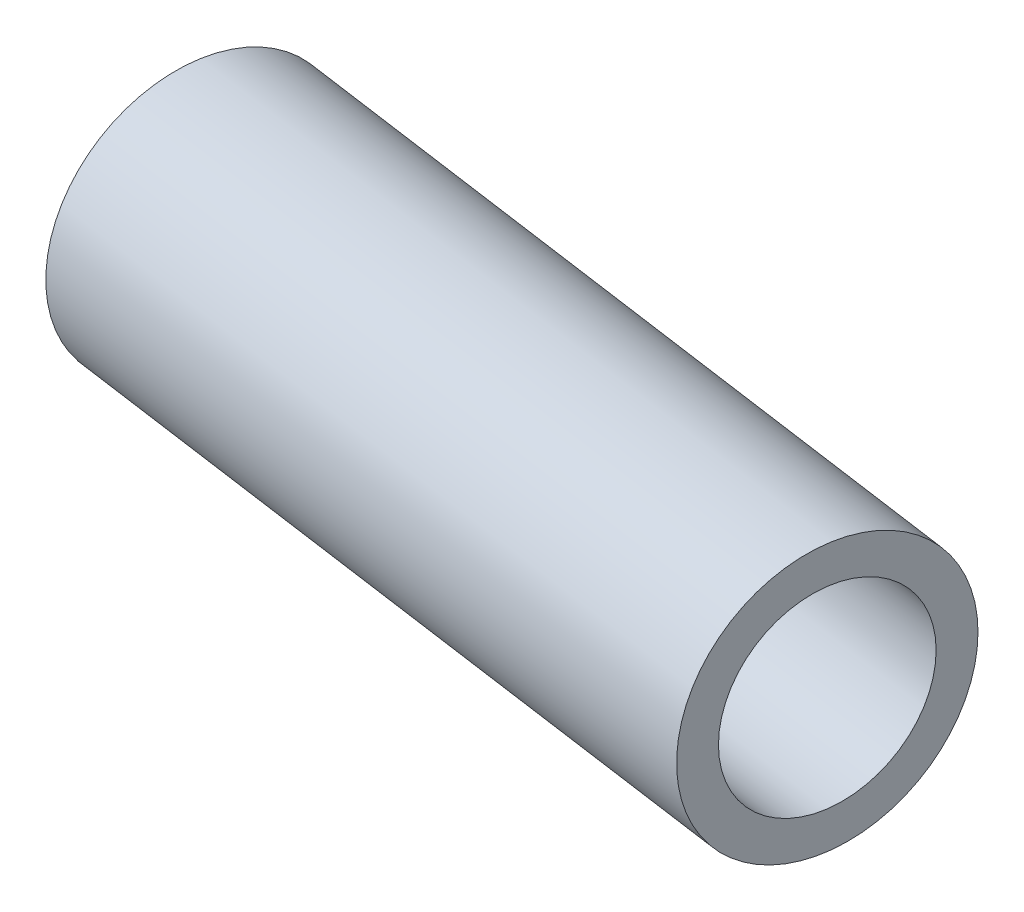
ISO-10303-21;
HEADER;
FILE_DESCRIPTION(('STEP AP214'),'2;1');
FILE_NAME('part.step','',(''),(''),'','','');
FILE_SCHEMA(('AUTOMOTIVE_DESIGN { 1 0 10303 214 1 1 1 1 }'));
ENDSEC;
DATA;
#1=APPLICATION_CONTEXT('core data for automotive mechanical design processes');
#2=APPLICATION_PROTOCOL_DEFINITION('international standard','automotive_design',2000,#1);
#3=PRODUCT_CONTEXT('',#1,'mechanical');
#4=PRODUCT('Part','Part','',(#3));
#5=PRODUCT_RELATED_PRODUCT_CATEGORY('part','',(#4));
#6=PRODUCT_DEFINITION_FORMATION('','',#4);
#7=PRODUCT_DEFINITION_CONTEXT('part definition',#1,'design');
#8=PRODUCT_DEFINITION('design','',#6,#7);
#9=PRODUCT_DEFINITION_SHAPE('','',#8);
#10=(LENGTH_UNIT() NAMED_UNIT(*) SI_UNIT(.MILLI.,.METRE.));
#11=(NAMED_UNIT(*) PLANE_ANGLE_UNIT() SI_UNIT($,.RADIAN.));
#12=(NAMED_UNIT(*) SI_UNIT($,.STERADIAN.) SOLID_ANGLE_UNIT());
#13=UNCERTAINTY_MEASURE_WITH_UNIT(LENGTH_MEASURE(1.E-05),#10,'distance_accuracy_value','');
#14=(GEOMETRIC_REPRESENTATION_CONTEXT(3) GLOBAL_UNCERTAINTY_ASSIGNED_CONTEXT((#13)) GLOBAL_UNIT_ASSIGNED_CONTEXT((#10,
#11,#12)) REPRESENTATION_CONTEXT('',''));
#15=CARTESIAN_POINT('',(0.,0.,0.));
#16=DIRECTION('',(0.,0.,1.));
#17=DIRECTION('',(1.,0.,0.));
#18=AXIS2_PLACEMENT_3D('',#15,#16,#17);
#19=CARTESIAN_POINT('',(63.4498517493906,-23.74921875,-357.68665863054));
#20=DIRECTION('',(0.990268068741571,0.,0.139173100960058));
#21=DIRECTION('',(0.139173100960058,0.,-0.990268068741571));
#22=AXIS2_PLACEMENT_3D('',#19,#20,#21);
#23=CYLINDRICAL_SURFACE('',#22,5.40078125000756);
#24=CARTESIAN_POINT('',(63.4498517493906,-23.74921875,-357.68665863054));
#25=DIRECTION('',(0.990268068741571,0.,0.139173100960058));
#26=DIRECTION('',(0.139173100960058,0.,-0.990268068741571));
#27=AXIS2_PLACEMENT_3D('',#24,#25,#26);
#28=CIRCLE('',#27,5.40078125000756);
#29=CARTESIAN_POINT('',(64.2014952235611,-23.74921875,-363.034879848681));
#30=VERTEX_POINT('',#29);
#31=EDGE_CURVE('E11',#30,#30,#28,.T.);
#32=ORIENTED_EDGE('',*,*,#31,.T.);
#33=EDGE_LOOP('',(#32));
#34=FACE_BOUND('',#33,.T.);
#35=CARTESIAN_POINT('',(93.1578938116377,-23.74921875,-353.511465601739));
#36=DIRECTION('',(0.990268068741571,0.,0.139173100960058));
#37=DIRECTION('',(0.139173100960058,0.,-0.990268068741571));
#38=AXIS2_PLACEMENT_3D('',#35,#36,#37);
#39=CIRCLE('',#38,5.40078125000756);
#40=CARTESIAN_POINT('',(93.9095372858082,-23.74921875,-358.859686819879));
#41=VERTEX_POINT('',#40);
#42=EDGE_CURVE('E48',#41,#41,#39,.T.);
#43=ORIENTED_EDGE('',*,*,#42,.F.);
#44=EDGE_LOOP('',(#43));
#45=FACE_BOUND('',#44,.T.);
#46=ADVANCED_FACE('F45',(#34,#45),#23,.T.);
#47=CARTESIAN_POINT('',(63.4498517493906,-23.74921875,-357.68665863054));
#48=DIRECTION('',(0.990268068741571,0.,0.139173100960058));
#49=DIRECTION('',(0.139173100960058,0.,-0.990268068741571));
#50=AXIS2_PLACEMENT_3D('',#47,#48,#49);
#51=PLANE('',#50);
#52=CARTESIAN_POINT('',(63.4498517493906,-23.74921875,-357.68665863054));
#53=DIRECTION('',(0.990268068741571,0.,0.139173100960058));
#54=DIRECTION('',(0.139173100960058,0.,-0.990268068741571));
#55=AXIS2_PLACEMENT_3D('',#52,#53,#54);
#56=CIRCLE('',#55,3.90078125000752);
#57=CARTESIAN_POINT('',(63.992735572121,-23.74921875,-361.549477745569));
#58=VERTEX_POINT('',#57);
#59=EDGE_CURVE('E55',#58,#58,#56,.T.);
#60=ORIENTED_EDGE('',*,*,#59,.T.);
#61=EDGE_LOOP('',(#60));
#62=FACE_BOUND('',#61,.T.);
#63=ORIENTED_EDGE('',*,*,#31,.F.);
#64=EDGE_LOOP('',(#63));
#65=FACE_BOUND('',#64,.T.);
#66=ADVANCED_FACE('F63',(#62,#65),#51,.F.);
#67=CARTESIAN_POINT('',(93.1578938116377,-23.74921875,-353.511465601739));
#68=DIRECTION('',(0.990268068741571,0.,0.139173100960058));
#69=DIRECTION('',(0.139173100960058,0.,-0.990268068741571));
#70=AXIS2_PLACEMENT_3D('',#67,#68,#69);
#71=PLANE('',#70);
#72=CARTESIAN_POINT('',(93.1578938116377,-23.74921875,-353.511465601739));
#73=DIRECTION('',(0.990268068741571,0.,0.139173100960058));
#74=DIRECTION('',(0.139173100960058,0.,-0.990268068741571));
#75=AXIS2_PLACEMENT_3D('',#72,#73,#74);
#76=CIRCLE('',#75,3.90078125000752);
#77=CARTESIAN_POINT('',(93.7007776343681,-23.74921875,-357.374284716767));
#78=VERTEX_POINT('',#77);
#79=EDGE_CURVE('E57',#78,#78,#76,.T.);
#80=ORIENTED_EDGE('',*,*,#79,.F.);
#81=EDGE_LOOP('',(#80));
#82=FACE_BOUND('',#81,.T.);
#83=ORIENTED_EDGE('',*,*,#42,.T.);
#84=EDGE_LOOP('',(#83));
#85=FACE_BOUND('',#84,.T.);
#86=ADVANCED_FACE('F69',(#82,#85),#71,.T.);
#87=CARTESIAN_POINT('',(63.4498517493906,-23.74921875,-357.68665863054));
#88=DIRECTION('',(0.990268068741571,0.,0.139173100960058));
#89=DIRECTION('',(0.139173100960058,0.,-0.990268068741571));
#90=AXIS2_PLACEMENT_3D('',#87,#88,#89);
#91=CYLINDRICAL_SURFACE('',#90,3.90078125000752);
#92=ORIENTED_EDGE('',*,*,#59,.F.);
#93=EDGE_LOOP('',(#92));
#94=FACE_BOUND('',#93,.T.);
#95=ORIENTED_EDGE('',*,*,#79,.T.);
#96=EDGE_LOOP('',(#95));
#97=FACE_BOUND('',#96,.T.);
#98=ADVANCED_FACE('F66',(#94,#97),#91,.F.);
#99=CLOSED_SHELL('',(#46,#66,#86,#98));
#100=MANIFOLD_SOLID_BREP('B2',#99);
#101=ADVANCED_BREP_SHAPE_REPRESENTATION('',(#18,#100),#14);
#102=SHAPE_DEFINITION_REPRESENTATION(#9,#101);
ENDSEC;
END-ISO-10303-21;
